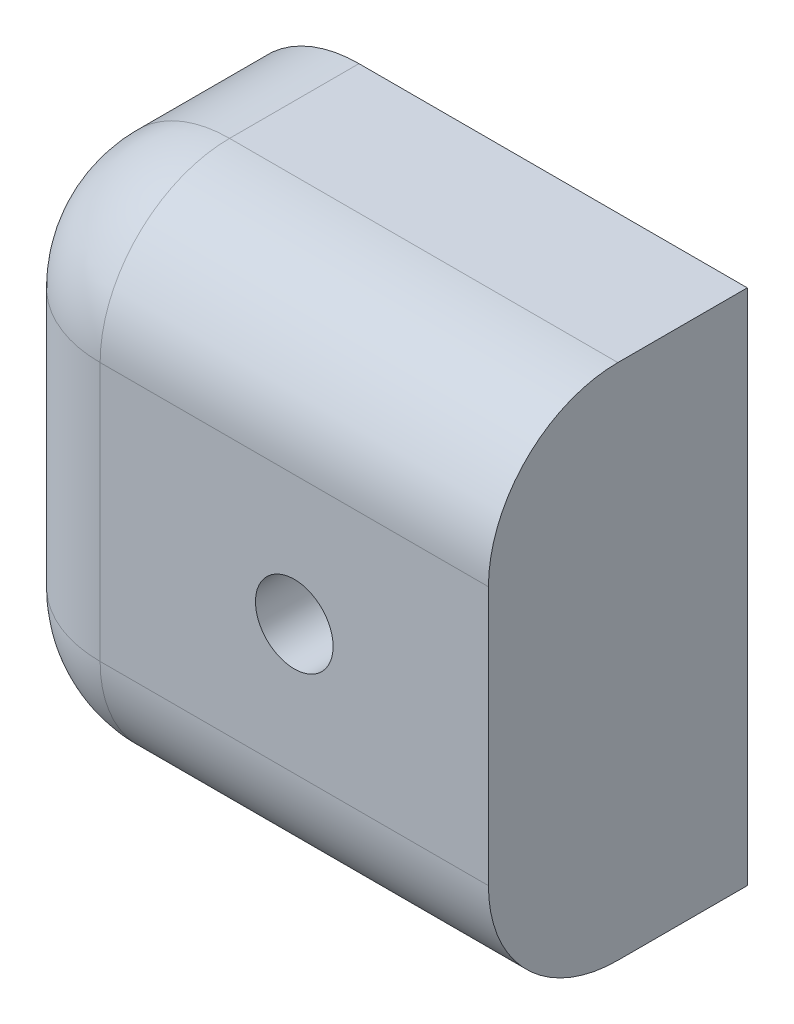
ISO-10303-21;
HEADER;
FILE_DESCRIPTION(('STEP AP214'),'2;1');
FILE_NAME('part.step','',(''),(''),'','','');
FILE_SCHEMA(('AUTOMOTIVE_DESIGN { 1 0 10303 214 1 1 1 1 }'));
ENDSEC;
DATA;
#1=APPLICATION_CONTEXT('core data for automotive mechanical design processes');
#2=APPLICATION_PROTOCOL_DEFINITION('international standard','automotive_design',2000,#1);
#3=PRODUCT_CONTEXT('',#1,'mechanical');
#4=PRODUCT('Part','Part','',(#3));
#5=PRODUCT_RELATED_PRODUCT_CATEGORY('part','',(#4));
#6=PRODUCT_DEFINITION_FORMATION('','',#4);
#7=PRODUCT_DEFINITION_CONTEXT('part definition',#1,'design');
#8=PRODUCT_DEFINITION('design','',#6,#7);
#9=PRODUCT_DEFINITION_SHAPE('','',#8);
#10=(LENGTH_UNIT() NAMED_UNIT(*) SI_UNIT(.MILLI.,.METRE.));
#11=(NAMED_UNIT(*) PLANE_ANGLE_UNIT() SI_UNIT($,.RADIAN.));
#12=(NAMED_UNIT(*) SI_UNIT($,.STERADIAN.) SOLID_ANGLE_UNIT());
#13=UNCERTAINTY_MEASURE_WITH_UNIT(LENGTH_MEASURE(1.E-05),#10,'distance_accuracy_value','');
#14=(GEOMETRIC_REPRESENTATION_CONTEXT(3) GLOBAL_UNCERTAINTY_ASSIGNED_CONTEXT((#13)) GLOBAL_UNIT_ASSIGNED_CONTEXT((#10,
#11,#12)) REPRESENTATION_CONTEXT('',''));
#15=CARTESIAN_POINT('',(0.,0.,0.));
#16=DIRECTION('',(0.,0.,1.));
#17=DIRECTION('',(1.,0.,0.));
#18=AXIS2_PLACEMENT_3D('',#15,#16,#17);
#19=CARTESIAN_POINT('',(20.,0.,10.));
#20=DIRECTION('',(-1.,0.,0.));
#21=DIRECTION('',(0.,-1.,0.));
#22=AXIS2_PLACEMENT_3D('',#19,#20,#21);
#23=PLANE('',#22);
#24=DIRECTION('',(0.,0.,-1.));
#25=VECTOR('',#24,1.);
#26=CARTESIAN_POINT('',(20.,20.,10.));
#27=LINE('',#26,#25);
#28=CARTESIAN_POINT('',(20.,20.,5.));
#29=VERTEX_POINT('',#28);
#30=CARTESIAN_POINT('',(20.,20.,0.));
#31=VERTEX_POINT('',#30);
#32=EDGE_CURVE('E103',#29,#31,#27,.T.);
#33=ORIENTED_EDGE('',*,*,#32,.F.);
#34=CARTESIAN_POINT('',(20.,15.,5.));
#35=DIRECTION('',(-1.,0.,0.));
#36=DIRECTION('',(0.,-1.,0.));
#37=AXIS2_PLACEMENT_3D('',#34,#35,#36);
#38=CIRCLE('',#37,5.);
#39=CARTESIAN_POINT('',(20.,15.,10.));
#40=VERTEX_POINT('',#39);
#41=EDGE_CURVE('E161',#29,#40,#38,.F.);
#42=ORIENTED_EDGE('',*,*,#41,.T.);
#43=DIRECTION('',(0.,1.,0.));
#44=VECTOR('',#43,1.);
#45=CARTESIAN_POINT('',(20.,0.,10.));
#46=LINE('',#45,#44);
#47=CARTESIAN_POINT('',(20.,5.,10.));
#48=VERTEX_POINT('',#47);
#49=EDGE_CURVE('E132',#48,#40,#46,.T.);
#50=ORIENTED_EDGE('',*,*,#49,.F.);
#51=CARTESIAN_POINT('',(20.,5.,5.));
#52=DIRECTION('',(-1.,0.,0.));
#53=DIRECTION('',(0.,-1.,0.));
#54=AXIS2_PLACEMENT_3D('',#51,#52,#53);
#55=CIRCLE('',#54,5.);
#56=CARTESIAN_POINT('',(20.,0.,5.));
#57=VERTEX_POINT('',#56);
#58=EDGE_CURVE('E159',#48,#57,#55,.F.);
#59=ORIENTED_EDGE('',*,*,#58,.T.);
#60=DIRECTION('',(0.,0.,-1.));
#61=VECTOR('',#60,1.);
#62=CARTESIAN_POINT('',(20.,0.,10.));
#63=LINE('',#62,#61);
#64=CARTESIAN_POINT('',(20.,0.,0.));
#65=VERTEX_POINT('',#64);
#66=EDGE_CURVE('E126',#57,#65,#63,.T.);
#67=ORIENTED_EDGE('',*,*,#66,.T.);
#68=DIRECTION('',(0.,1.,0.));
#69=VECTOR('',#68,1.);
#70=CARTESIAN_POINT('',(20.,0.,0.));
#71=LINE('',#70,#69);
#72=EDGE_CURVE('E121',#65,#31,#71,.T.);
#73=ORIENTED_EDGE('',*,*,#72,.T.);
#74=EDGE_LOOP('',(#33,#42,#50,#59,#67,#73));
#75=FACE_BOUND('',#74,.T.);
#76=ADVANCED_FACE('F38',(#75),#23,.F.);
#77=CARTESIAN_POINT('',(5.00000000000003,20.,10.));
#78=DIRECTION('',(0.,-1.,0.));
#79=DIRECTION('',(0.,0.,-1.));
#80=AXIS2_PLACEMENT_3D('',#77,#78,#79);
#81=PLANE('',#80);
#82=DIRECTION('',(0.,0.,-1.));
#83=VECTOR('',#82,1.);
#84=CARTESIAN_POINT('',(5.00000000000003,20.,10.));
#85=LINE('',#84,#83);
#86=CARTESIAN_POINT('',(5.00000000000003,20.,5.));
#87=VERTEX_POINT('',#86);
#88=CARTESIAN_POINT('',(5.00000000000003,20.,0.));
#89=VERTEX_POINT('',#88);
#90=EDGE_CURVE('E115',#87,#89,#85,.T.);
#91=ORIENTED_EDGE('',*,*,#90,.F.);
#92=DIRECTION('',(-1.,0.,0.));
#93=VECTOR('',#92,1.);
#94=CARTESIAN_POINT('',(5.00000000000003,20.,5.));
#95=LINE('',#94,#93);
#96=EDGE_CURVE('E110',#87,#29,#95,.F.);
#97=ORIENTED_EDGE('',*,*,#96,.T.);
#98=ORIENTED_EDGE('',*,*,#32,.T.);
#99=DIRECTION('',(-1.,0.,0.));
#100=VECTOR('',#99,1.);
#101=CARTESIAN_POINT('',(5.00000000000003,20.,0.));
#102=LINE('',#101,#100);
#103=EDGE_CURVE('E107',#31,#89,#102,.T.);
#104=ORIENTED_EDGE('',*,*,#103,.T.);
#105=EDGE_LOOP('',(#91,#97,#98,#104));
#106=FACE_BOUND('',#105,.T.);
#107=ADVANCED_FACE('F106',(#106),#81,.F.);
#108=CARTESIAN_POINT('',(5.,15.,10.));
#109=DIRECTION('',(0.,0.,-1.));
#110=DIRECTION('',(-1.,0.,0.));
#111=AXIS2_PLACEMENT_3D('',#108,#109,#110);
#112=CYLINDRICAL_SURFACE('',#111,5.);
#113=DIRECTION('',(0.,0.,-1.));
#114=VECTOR('',#113,1.);
#115=CARTESIAN_POINT('',(0.,15.,10.));
#116=LINE('',#115,#114);
#117=CARTESIAN_POINT('',(0.,15.,5.));
#118=VERTEX_POINT('',#117);
#119=CARTESIAN_POINT('',(0.,15.,0.));
#120=VERTEX_POINT('',#119);
#121=EDGE_CURVE('E149',#118,#120,#116,.T.);
#122=ORIENTED_EDGE('',*,*,#121,.F.);
#123=CARTESIAN_POINT('',(5.,15.,5.));
#124=DIRECTION('',(0.,0.,-1.));
#125=DIRECTION('',(-1.,0.,0.));
#126=AXIS2_PLACEMENT_3D('',#123,#124,#125);
#127=CIRCLE('',#126,5.);
#128=EDGE_CURVE('E163',#118,#87,#127,.T.);
#129=ORIENTED_EDGE('',*,*,#128,.T.);
#130=ORIENTED_EDGE('',*,*,#90,.T.);
#131=CARTESIAN_POINT('',(5.,15.,0.));
#132=DIRECTION('',(0.,0.,1.));
#133=DIRECTION('',(-1.,0.,0.));
#134=AXIS2_PLACEMENT_3D('',#131,#132,#133);
#135=CIRCLE('',#134,5.);
#136=EDGE_CURVE('E124',#89,#120,#135,.T.);
#137=ORIENTED_EDGE('',*,*,#136,.T.);
#138=EDGE_LOOP('',(#122,#129,#130,#137));
#139=FACE_BOUND('',#138,.T.);
#140=ADVANCED_FACE('F199',(#139),#112,.T.);
#141=CARTESIAN_POINT('',(0.,5.00000000000003,10.));
#142=DIRECTION('',(1.,0.,0.));
#143=DIRECTION('',(0.,1.,0.));
#144=AXIS2_PLACEMENT_3D('',#141,#142,#143);
#145=PLANE('',#144);
#146=DIRECTION('',(0.,0.,-1.));
#147=VECTOR('',#146,1.);
#148=CARTESIAN_POINT('',(0.,5.00000000000003,10.));
#149=LINE('',#148,#147);
#150=CARTESIAN_POINT('',(0.,5.00000000000003,5.));
#151=VERTEX_POINT('',#150);
#152=CARTESIAN_POINT('',(0.,5.00000000000003,0.));
#153=VERTEX_POINT('',#152);
#154=EDGE_CURVE('E147',#151,#153,#149,.T.);
#155=ORIENTED_EDGE('',*,*,#154,.F.);
#156=DIRECTION('',(0.,-1.,0.));
#157=VECTOR('',#156,1.);
#158=CARTESIAN_POINT('',(0.,5.00000000000003,5.));
#159=LINE('',#158,#157);
#160=EDGE_CURVE('E165',#151,#118,#159,.F.);
#161=ORIENTED_EDGE('',*,*,#160,.T.);
#162=ORIENTED_EDGE('',*,*,#121,.T.);
#163=DIRECTION('',(0.,-1.,0.));
#164=VECTOR('',#163,1.);
#165=CARTESIAN_POINT('',(0.,5.00000000000003,0.));
#166=LINE('',#165,#164);
#167=EDGE_CURVE('E136',#120,#153,#166,.T.);
#168=ORIENTED_EDGE('',*,*,#167,.T.);
#169=EDGE_LOOP('',(#155,#161,#162,#168));
#170=FACE_BOUND('',#169,.T.);
#171=ADVANCED_FACE('F201',(#170),#145,.F.);
#172=CARTESIAN_POINT('',(5.,5.,10.));
#173=DIRECTION('',(0.,0.,-1.));
#174=DIRECTION('',(-1.,0.,0.));
#175=AXIS2_PLACEMENT_3D('',#172,#173,#174);
#176=CYLINDRICAL_SURFACE('',#175,5.);
#177=DIRECTION('',(0.,0.,-1.));
#178=VECTOR('',#177,1.);
#179=CARTESIAN_POINT('',(5.00000000000004,0.,10.));
#180=LINE('',#179,#178);
#181=CARTESIAN_POINT('',(5.00000000000004,0.,5.));
#182=VERTEX_POINT('',#181);
#183=CARTESIAN_POINT('',(5.00000000000004,0.,0.));
#184=VERTEX_POINT('',#183);
#185=EDGE_CURVE('E145',#182,#184,#180,.T.);
#186=ORIENTED_EDGE('',*,*,#185,.F.);
#187=CARTESIAN_POINT('',(5.,5.,5.));
#188=DIRECTION('',(0.,0.,-1.));
#189=DIRECTION('',(-1.,0.,0.));
#190=AXIS2_PLACEMENT_3D('',#187,#188,#189);
#191=CIRCLE('',#190,5.);
#192=EDGE_CURVE('E11',#182,#151,#191,.T.);
#193=ORIENTED_EDGE('',*,*,#192,.T.);
#194=ORIENTED_EDGE('',*,*,#154,.T.);
#195=CARTESIAN_POINT('',(5.,5.,0.));
#196=DIRECTION('',(0.,0.,1.));
#197=DIRECTION('',(-1.,0.,0.));
#198=AXIS2_PLACEMENT_3D('',#195,#196,#197);
#199=CIRCLE('',#198,5.);
#200=EDGE_CURVE('E139',#153,#184,#199,.T.);
#201=ORIENTED_EDGE('',*,*,#200,.T.);
#202=EDGE_LOOP('',(#186,#193,#194,#201));
#203=FACE_BOUND('',#202,.T.);
#204=ADVANCED_FACE('F203',(#203),#176,.T.);
#205=CARTESIAN_POINT('',(5.00000000000003,0.,10.));
#206=DIRECTION('',(0.,1.,0.));
#207=DIRECTION('',(0.,0.,1.));
#208=AXIS2_PLACEMENT_3D('',#205,#206,#207);
#209=PLANE('',#208);
#210=ORIENTED_EDGE('',*,*,#66,.F.);
#211=DIRECTION('',(1.,0.,0.));
#212=VECTOR('',#211,1.);
#213=CARTESIAN_POINT('',(5.00000000000003,0.,5.));
#214=LINE('',#213,#212);
#215=EDGE_CURVE('E47',#57,#182,#214,.F.);
#216=ORIENTED_EDGE('',*,*,#215,.T.);
#217=ORIENTED_EDGE('',*,*,#185,.T.);
#218=DIRECTION('',(1.,0.,0.));
#219=VECTOR('',#218,1.);
#220=CARTESIAN_POINT('',(5.00000000000003,0.,0.));
#221=LINE('',#220,#219);
#222=EDGE_CURVE('E142',#184,#65,#221,.T.);
#223=ORIENTED_EDGE('',*,*,#222,.T.);
#224=EDGE_LOOP('',(#210,#216,#217,#223));
#225=FACE_BOUND('',#224,.T.);
#226=ADVANCED_FACE('F204',(#225),#209,.F.);
#227=CARTESIAN_POINT('',(5.,15.,10.));
#228=DIRECTION('',(0.,0.,-1.));
#229=DIRECTION('',(-1.,0.,0.));
#230=AXIS2_PLACEMENT_3D('',#227,#228,#229);
#231=PLANE('',#230);
#232=CARTESIAN_POINT('',(12.5,10.,10.));
#233=DIRECTION('',(0.,0.,1.));
#234=DIRECTION('',(1.,0.,0.));
#235=AXIS2_PLACEMENT_3D('',#232,#233,#234);
#236=CIRCLE('',#235,1.5);
#237=CARTESIAN_POINT('',(14.,10.,10.));
#238=VERTEX_POINT('',#237);
#239=EDGE_CURVE('E249',#238,#238,#236,.T.);
#240=ORIENTED_EDGE('',*,*,#239,.F.);
#241=EDGE_LOOP('',(#240));
#242=FACE_BOUND('',#241,.T.);
#243=ORIENTED_EDGE('',*,*,#49,.T.);
#244=DIRECTION('',(-1.,0.,0.));
#245=VECTOR('',#244,1.);
#246=CARTESIAN_POINT('',(5.,15.,10.));
#247=LINE('',#246,#245);
#248=CARTESIAN_POINT('',(5.,15.,10.));
#249=VERTEX_POINT('',#248);
#250=EDGE_CURVE('E155',#40,#249,#247,.T.);
#251=ORIENTED_EDGE('',*,*,#250,.T.);
#252=DIRECTION('',(0.,-1.,0.));
#253=VECTOR('',#252,1.);
#254=CARTESIAN_POINT('',(5.,15.,10.));
#255=LINE('',#254,#253);
#256=CARTESIAN_POINT('',(5.00000000000004,5.,10.));
#257=VERTEX_POINT('',#256);
#258=EDGE_CURVE('E153',#249,#257,#255,.T.);
#259=ORIENTED_EDGE('',*,*,#258,.T.);
#260=DIRECTION('',(1.,0.,0.));
#261=VECTOR('',#260,1.);
#262=CARTESIAN_POINT('',(5.,5.,10.));
#263=LINE('',#262,#261);
#264=EDGE_CURVE('E114',#257,#48,#263,.T.);
#265=ORIENTED_EDGE('',*,*,#264,.T.);
#266=EDGE_LOOP('',(#243,#251,#259,#265));
#267=FACE_BOUND('',#266,.T.);
#268=ADVANCED_FACE('F189',(#242,#267),#231,.F.);
#269=CARTESIAN_POINT('',(5.,15.,0.));
#270=DIRECTION('',(0.,0.,-1.));
#271=DIRECTION('',(-1.,0.,0.));
#272=AXIS2_PLACEMENT_3D('',#269,#270,#271);
#273=PLANE('',#272);
#274=CARTESIAN_POINT('',(12.5,10.,0.));
#275=DIRECTION('',(0.,0.,1.));
#276=DIRECTION('',(1.,0.,0.));
#277=AXIS2_PLACEMENT_3D('',#274,#275,#276);
#278=CIRCLE('',#277,1.5);
#279=CARTESIAN_POINT('',(14.,10.,0.));
#280=VERTEX_POINT('',#279);
#281=EDGE_CURVE('E171',#280,#280,#278,.T.);
#282=ORIENTED_EDGE('',*,*,#281,.T.);
#283=EDGE_LOOP('',(#282));
#284=FACE_BOUND('',#283,.T.);
#285=ORIENTED_EDGE('',*,*,#72,.F.);
#286=ORIENTED_EDGE('',*,*,#222,.F.);
#287=ORIENTED_EDGE('',*,*,#200,.F.);
#288=ORIENTED_EDGE('',*,*,#167,.F.);
#289=ORIENTED_EDGE('',*,*,#136,.F.);
#290=ORIENTED_EDGE('',*,*,#103,.F.);
#291=EDGE_LOOP('',(#285,#286,#287,#288,#289,#290));
#292=FACE_BOUND('',#291,.T.);
#293=ADVANCED_FACE('F119',(#284,#292),#273,.T.);
#294=CARTESIAN_POINT('',(5.,5.,5.));
#295=DIRECTION('',(1.,0.,0.));
#296=DIRECTION('',(0.,0.,-1.));
#297=AXIS2_PLACEMENT_3D('',#294,#295,#296);
#298=CYLINDRICAL_SURFACE('',#297,5.);
#299=CARTESIAN_POINT('',(5.00000000000004,5.,5.));
#300=DIRECTION('',(-1.,0.,0.));
#301=DIRECTION('',(0.,0.,1.));
#302=AXIS2_PLACEMENT_3D('',#299,#300,#301);
#303=CIRCLE('',#302,5.);
#304=EDGE_CURVE('E42',#182,#257,#303,.T.);
#305=ORIENTED_EDGE('',*,*,#304,.F.);
#306=ORIENTED_EDGE('',*,*,#215,.F.);
#307=ORIENTED_EDGE('',*,*,#58,.F.);
#308=ORIENTED_EDGE('',*,*,#264,.F.);
#309=EDGE_LOOP('',(#305,#306,#307,#308));
#310=FACE_BOUND('',#309,.T.);
#311=ADVANCED_FACE('F40',(#310),#298,.T.);
#312=CARTESIAN_POINT('',(5.,5.,5.));
#313=DIRECTION('',(0.,0.,-1.));
#314=DIRECTION('',(-1.,0.,0.));
#315=AXIS2_PLACEMENT_3D('',#312,#313,#314);
#316=SPHERICAL_SURFACE('',#315,5.);
#317=ORIENTED_EDGE('',*,*,#192,.F.);
#318=ORIENTED_EDGE('',*,*,#304,.T.);
#319=CARTESIAN_POINT('',(5.,5.,5.));
#320=DIRECTION('',(0.,1.,0.));
#321=DIRECTION('',(-1.,0.,0.));
#322=AXIS2_PLACEMENT_3D('',#319,#320,#321);
#323=CIRCLE('',#322,5.);
#324=EDGE_CURVE('E130',#151,#257,#323,.T.);
#325=ORIENTED_EDGE('',*,*,#324,.F.);
#326=EDGE_LOOP('',(#317,#318,#325));
#327=FACE_BOUND('',#326,.T.);
#328=ADVANCED_FACE('F181',(#327),#316,.T.);
#329=CARTESIAN_POINT('',(5.,15.,5.));
#330=DIRECTION('',(0.,-1.,0.));
#331=DIRECTION('',(1.,0.,0.));
#332=AXIS2_PLACEMENT_3D('',#329,#330,#331);
#333=CYLINDRICAL_SURFACE('',#332,5.);
#334=CARTESIAN_POINT('',(5.,15.,5.));
#335=DIRECTION('',(0.,1.,0.));
#336=DIRECTION('',(0.,0.,1.));
#337=AXIS2_PLACEMENT_3D('',#334,#335,#336);
#338=CIRCLE('',#337,5.);
#339=EDGE_CURVE('E170',#118,#249,#338,.T.);
#340=ORIENTED_EDGE('',*,*,#339,.F.);
#341=ORIENTED_EDGE('',*,*,#160,.F.);
#342=ORIENTED_EDGE('',*,*,#324,.T.);
#343=ORIENTED_EDGE('',*,*,#258,.F.);
#344=EDGE_LOOP('',(#340,#341,#342,#343));
#345=FACE_BOUND('',#344,.T.);
#346=ADVANCED_FACE('F179',(#345),#333,.T.);
#347=CARTESIAN_POINT('',(5.,15.,5.));
#348=DIRECTION('',(0.,0.,-1.));
#349=DIRECTION('',(-1.,0.,0.));
#350=AXIS2_PLACEMENT_3D('',#347,#348,#349);
#351=SPHERICAL_SURFACE('',#350,5.);
#352=ORIENTED_EDGE('',*,*,#128,.F.);
#353=ORIENTED_EDGE('',*,*,#339,.T.);
#354=CARTESIAN_POINT('',(5.,15.,5.));
#355=DIRECTION('',(1.,0.,0.));
#356=DIRECTION('',(0.,1.,0.));
#357=AXIS2_PLACEMENT_3D('',#354,#355,#356);
#358=CIRCLE('',#357,5.);
#359=EDGE_CURVE('E168',#87,#249,#358,.T.);
#360=ORIENTED_EDGE('',*,*,#359,.F.);
#361=EDGE_LOOP('',(#352,#353,#360));
#362=FACE_BOUND('',#361,.T.);
#363=ADVANCED_FACE('F196',(#362),#351,.T.);
#364=CARTESIAN_POINT('',(5.,15.,5.));
#365=DIRECTION('',(-1.,0.,0.));
#366=DIRECTION('',(0.,0.,1.));
#367=AXIS2_PLACEMENT_3D('',#364,#365,#366);
#368=CYLINDRICAL_SURFACE('',#367,5.);
#369=ORIENTED_EDGE('',*,*,#41,.F.);
#370=ORIENTED_EDGE('',*,*,#96,.F.);
#371=ORIENTED_EDGE('',*,*,#359,.T.);
#372=ORIENTED_EDGE('',*,*,#250,.F.);
#373=EDGE_LOOP('',(#369,#370,#371,#372));
#374=FACE_BOUND('',#373,.T.);
#375=ADVANCED_FACE('F192',(#374),#368,.T.);
#376=CARTESIAN_POINT('',(12.5,10.,0.));
#377=DIRECTION('',(0.,0.,1.));
#378=DIRECTION('',(1.,0.,0.));
#379=AXIS2_PLACEMENT_3D('',#376,#377,#378);
#380=CYLINDRICAL_SURFACE('',#379,1.5);
#381=ORIENTED_EDGE('',*,*,#281,.F.);
#382=EDGE_LOOP('',(#381));
#383=FACE_BOUND('',#382,.T.);
#384=ORIENTED_EDGE('',*,*,#239,.T.);
#385=EDGE_LOOP('',(#384));
#386=FACE_BOUND('',#385,.T.);
#387=ADVANCED_FACE('F225',(#383,#386),#380,.F.);
#388=CLOSED_SHELL('',(#76,#107,#140,#171,#204,#226,#268,#293,#311,#328,#346,#363,#375,#387));
#389=MANIFOLD_SOLID_BREP('B2',#388);
#390=ADVANCED_BREP_SHAPE_REPRESENTATION('',(#18,#389),#14);
#391=SHAPE_DEFINITION_REPRESENTATION(#9,#390);
ENDSEC;
END-ISO-10303-21;
